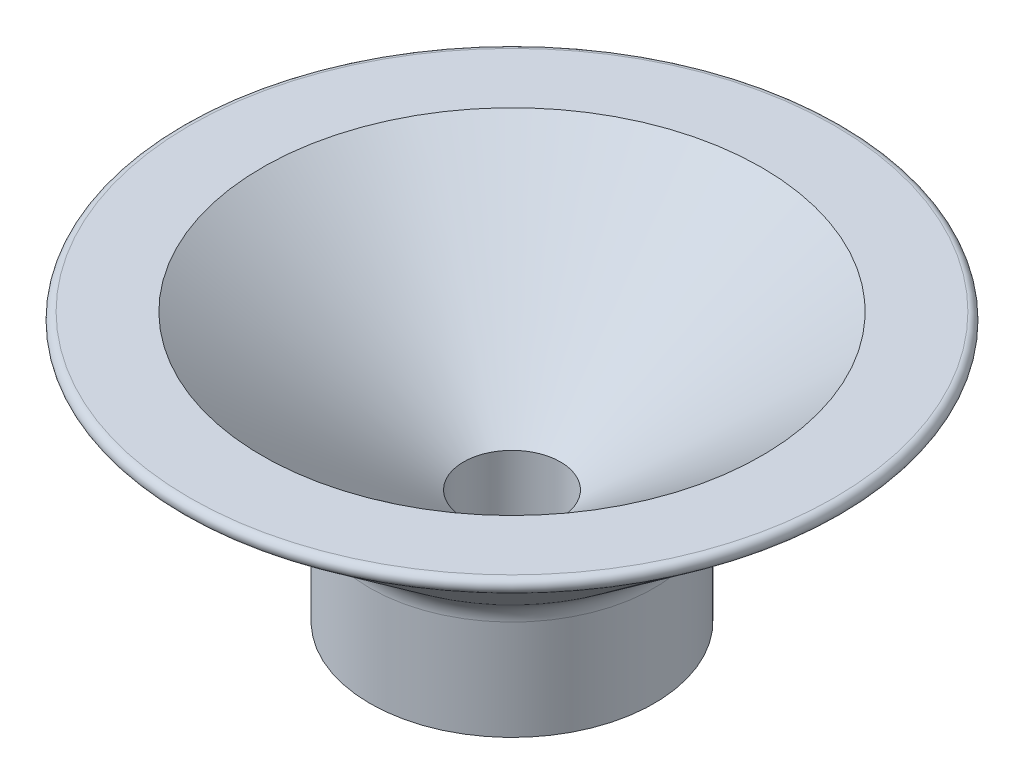
ISO-10303-21;
HEADER;
FILE_DESCRIPTION(('STEP AP214'),'2;1');
FILE_NAME('part.step','',(''),(''),'','','');
FILE_SCHEMA(('AUTOMOTIVE_DESIGN { 1 0 10303 214 1 1 1 1 }'));
ENDSEC;
DATA;
#1=APPLICATION_CONTEXT('core data for automotive mechanical design processes');
#2=APPLICATION_PROTOCOL_DEFINITION('international standard','automotive_design',2000,#1);
#3=PRODUCT_CONTEXT('',#1,'mechanical');
#4=PRODUCT('Part','Part','',(#3));
#5=PRODUCT_RELATED_PRODUCT_CATEGORY('part','',(#4));
#6=PRODUCT_DEFINITION_FORMATION('','',#4);
#7=PRODUCT_DEFINITION_CONTEXT('part definition',#1,'design');
#8=PRODUCT_DEFINITION('design','',#6,#7);
#9=PRODUCT_DEFINITION_SHAPE('','',#8);
#10=(LENGTH_UNIT() NAMED_UNIT(*) SI_UNIT(.MILLI.,.METRE.));
#11=(NAMED_UNIT(*) PLANE_ANGLE_UNIT() SI_UNIT($,.RADIAN.));
#12=(NAMED_UNIT(*) SI_UNIT($,.STERADIAN.) SOLID_ANGLE_UNIT());
#13=UNCERTAINTY_MEASURE_WITH_UNIT(LENGTH_MEASURE(1.E-05),#10,'distance_accuracy_value','');
#14=(GEOMETRIC_REPRESENTATION_CONTEXT(3) GLOBAL_UNCERTAINTY_ASSIGNED_CONTEXT((#13)) GLOBAL_UNIT_ASSIGNED_CONTEXT((#10,
#11,#12)) REPRESENTATION_CONTEXT('',''));
#15=CARTESIAN_POINT('',(0.,0.,0.));
#16=DIRECTION('',(0.,0.,1.));
#17=DIRECTION('',(1.,0.,0.));
#18=AXIS2_PLACEMENT_3D('',#15,#16,#17);
#19=CARTESIAN_POINT('',(0.,0.,0.));
#20=DIRECTION('',(0.,1.,0.));
#21=DIRECTION('',(0.,0.,1.));
#22=AXIS2_PLACEMENT_3D('',#19,#20,#21);
#23=CONICAL_SURFACE('',#22,1.7,0.916648806417325);
#24=CARTESIAN_POINT('',(0.,5.416408,0.));
#25=DIRECTION('',(0.,-1.,0.));
#26=DIRECTION('',(0.,0.,-1.));
#27=AXIS2_PLACEMENT_3D('',#24,#25,#26);
#28=CIRCLE('',#27,8.76393202);
#29=CARTESIAN_POINT('',(0.,5.416408,-8.76393202));
#30=VERTEX_POINT('',#29);
#31=EDGE_CURVE('E66',#30,#30,#28,.T.);
#32=ORIENTED_EDGE('',*,*,#31,.F.);
#33=EDGE_LOOP('',(#32));
#34=FACE_BOUND('',#33,.T.);
#35=CARTESIAN_POINT('',(0.,0.,0.));
#36=DIRECTION('',(0.,-1.,0.));
#37=DIRECTION('',(0.,0.,-1.));
#38=AXIS2_PLACEMENT_3D('',#35,#36,#37);
#39=CIRCLE('',#38,1.7);
#40=CARTESIAN_POINT('',(0.,0.,-1.7));
#41=VERTEX_POINT('',#40);
#42=EDGE_CURVE('E75',#41,#41,#39,.T.);
#43=ORIENTED_EDGE('',*,*,#42,.T.);
#44=EDGE_LOOP('',(#43));
#45=FACE_BOUND('',#44,.T.);
#46=ADVANCED_FACE('F42',(#34,#45),#23,.F.);
#47=CARTESIAN_POINT('',(0.,5.416408,0.));
#48=DIRECTION('',(0.,1.,0.));
#49=DIRECTION('',(0.,0.,1.));
#50=AXIS2_PLACEMENT_3D('',#47,#48,#49);
#51=CONICAL_SURFACE('',#50,12.0507947844037,0.916648806417325);
#52=CARTESIAN_POINT('',(0.,0.300203342163944,0.));
#53=DIRECTION('',(0.,1.,0.));
#54=DIRECTION('',(0.,0.,1.));
#55=AXIS2_PLACEMENT_3D('',#52,#53,#54);
#56=CIRCLE('',#55,5.37837979953523);
#57=CARTESIAN_POINT('',(0.,0.300203342163944,5.37837979953523));
#58=VERTEX_POINT('',#57);
#59=EDGE_CURVE('E10',#58,#58,#56,.T.);
#60=ORIENTED_EDGE('',*,*,#59,.T.);
#61=EDGE_LOOP('',(#60));
#62=FACE_BOUND('',#61,.T.);
#63=CARTESIAN_POINT('',(0.,4.96801626607049,0.));
#64=DIRECTION('',(0.,-1.,0.));
#65=DIRECTION('',(0.,0.,-1.));
#66=AXIS2_PLACEMENT_3D('',#63,#64,#65);
#67=CIRCLE('',#66,11.4660144785611);
#68=CARTESIAN_POINT('',(0.,4.96801626607049,-11.4660144785611));
#69=VERTEX_POINT('',#68);
#70=EDGE_CURVE('E60',#69,#69,#67,.T.);
#71=ORIENTED_EDGE('',*,*,#70,.T.);
#72=EDGE_LOOP('',(#71));
#73=FACE_BOUND('',#72,.T.);
#74=ADVANCED_FACE('F97',(#62,#73),#51,.T.);
#75=CARTESIAN_POINT('',(-12.0507947844037,5.416408,0.));
#76=DIRECTION('',(0.,-1.,0.));
#77=DIRECTION('',(0.,0.,-1.));
#78=AXIS2_PLACEMENT_3D('',#75,#76,#77);
#79=PLANE('',#78);
#80=CARTESIAN_POINT('',(0.,5.416408,0.));
#81=DIRECTION('',(0.,-1.,0.));
#82=DIRECTION('',(0.,0.,-1.));
#83=AXIS2_PLACEMENT_3D('',#80,#81,#82);
#84=CIRCLE('',#83,11.313893737344);
#85=CARTESIAN_POINT('',(0.,5.416408,-11.313893737344));
#86=VERTEX_POINT('',#85);
#87=EDGE_CURVE('E55',#86,#86,#84,.F.);
#88=ORIENTED_EDGE('',*,*,#87,.T.);
#89=EDGE_LOOP('',(#88));
#90=FACE_BOUND('',#89,.T.);
#91=ORIENTED_EDGE('',*,*,#31,.T.);
#92=EDGE_LOOP('',(#91));
#93=FACE_BOUND('',#92,.T.);
#94=ADVANCED_FACE('F89',(#90,#93),#79,.F.);
#95=CARTESIAN_POINT('',(0.,-4.,0.));
#96=DIRECTION('',(0.,-1.,0.));
#97=DIRECTION('',(0.,0.,-1.));
#98=AXIS2_PLACEMENT_3D('',#95,#96,#97);
#99=PLANE('',#98);
#100=CARTESIAN_POINT('',(0.,-4.,0.));
#101=DIRECTION('',(0.,-1.,0.));
#102=DIRECTION('',(0.,0.,-1.));
#103=AXIS2_PLACEMENT_3D('',#100,#101,#102);
#104=CIRCLE('',#103,4.98686276440366);
#105=CARTESIAN_POINT('',(0.,-4.,-4.98686276440366));
#106=VERTEX_POINT('',#105);
#107=EDGE_CURVE('E70',#106,#106,#104,.T.);
#108=ORIENTED_EDGE('',*,*,#107,.T.);
#109=EDGE_LOOP('',(#108));
#110=FACE_BOUND('',#109,.T.);
#111=CARTESIAN_POINT('',(0.,-4.,0.));
#112=DIRECTION('',(0.,-1.,0.));
#113=DIRECTION('',(0.,0.,-1.));
#114=AXIS2_PLACEMENT_3D('',#111,#112,#113);
#115=CIRCLE('',#114,1.7);
#116=CARTESIAN_POINT('',(0.,-4.,-1.7));
#117=VERTEX_POINT('',#116);
#118=EDGE_CURVE('E74',#117,#117,#115,.T.);
#119=ORIENTED_EDGE('',*,*,#118,.F.);
#120=EDGE_LOOP('',(#119));
#121=FACE_BOUND('',#120,.T.);
#122=ADVANCED_FACE('F86',(#110,#121),#99,.T.);
#123=CARTESIAN_POINT('',(0.,-4.,0.));
#124=DIRECTION('',(0.,1.,0.));
#125=DIRECTION('',(0.,0.,1.));
#126=AXIS2_PLACEMENT_3D('',#123,#124,#125);
#127=CYLINDRICAL_SURFACE('',#126,4.98686276440366);
#128=CARTESIAN_POINT('',(0.,-0.493363593554097,0.));
#129=DIRECTION('',(0.,-1.,0.));
#130=DIRECTION('',(0.,0.,-1.));
#131=AXIS2_PLACEMENT_3D('',#128,#129,#130);
#132=CIRCLE('',#131,4.98686276440366);
#133=CARTESIAN_POINT('',(0.,-0.493363593554097,-4.98686276440366));
#134=VERTEX_POINT('',#133);
#135=EDGE_CURVE('E50',#134,#134,#132,.T.);
#136=ORIENTED_EDGE('',*,*,#135,.T.);
#137=EDGE_LOOP('',(#136));
#138=FACE_BOUND('',#137,.T.);
#139=ORIENTED_EDGE('',*,*,#107,.F.);
#140=EDGE_LOOP('',(#139));
#141=FACE_BOUND('',#140,.T.);
#142=ADVANCED_FACE('F88',(#138,#141),#127,.T.);
#143=CARTESIAN_POINT('',(0.,-4.,0.));
#144=DIRECTION('',(0.,1.,0.));
#145=DIRECTION('',(0.,0.,1.));
#146=AXIS2_PLACEMENT_3D('',#143,#144,#145);
#147=CYLINDRICAL_SURFACE('',#146,1.7);
#148=ORIENTED_EDGE('',*,*,#118,.T.);
#149=EDGE_LOOP('',(#148));
#150=FACE_BOUND('',#149,.T.);
#151=ORIENTED_EDGE('',*,*,#42,.F.);
#152=EDGE_LOOP('',(#151));
#153=FACE_BOUND('',#152,.T.);
#154=ADVANCED_FACE('F83',(#150,#153),#147,.F.);
#155=CARTESIAN_POINT('',(0.,5.166408,0.));
#156=DIRECTION('',(0.,-1.,0.));
#157=DIRECTION('',(0.,0.,-1.));
#158=AXIS2_PLACEMENT_3D('',#155,#156,#157);
#159=TOROIDAL_SURFACE('',#158,11.313893737344,0.25);
#160=ORIENTED_EDGE('',*,*,#87,.F.);
#161=EDGE_LOOP('',(#160));
#162=FACE_BOUND('',#161,.T.);
#163=ORIENTED_EDGE('',*,*,#70,.F.);
#164=EDGE_LOOP('',(#163));
#165=FACE_BOUND('',#164,.T.);
#166=ADVANCED_FACE('F110',(#162,#165),#159,.T.);
#167=CARTESIAN_POINT('',(0.,-0.493363593554097,0.));
#168=DIRECTION('',(0.,-1.,0.));
#169=DIRECTION('',(0.,0.,-1.));
#170=AXIS2_PLACEMENT_3D('',#167,#168,#169);
#171=TOROIDAL_SURFACE('',#170,5.98686276440366,1.);
#172=ORIENTED_EDGE('',*,*,#59,.F.);
#173=EDGE_LOOP('',(#172));
#174=FACE_BOUND('',#173,.T.);
#175=ORIENTED_EDGE('',*,*,#135,.F.);
#176=EDGE_LOOP('',(#175));
#177=FACE_BOUND('',#176,.T.);
#178=ADVANCED_FACE('F44',(#174,#177),#171,.F.);
#179=CLOSED_SHELL('',(#46,#74,#94,#122,#142,#154,#166,#178));
#180=MANIFOLD_SOLID_BREP('B2',#179);
#181=ADVANCED_BREP_SHAPE_REPRESENTATION('',(#18,#180),#14);
#182=SHAPE_DEFINITION_REPRESENTATION(#9,#181);
ENDSEC;
END-ISO-10303-21;
